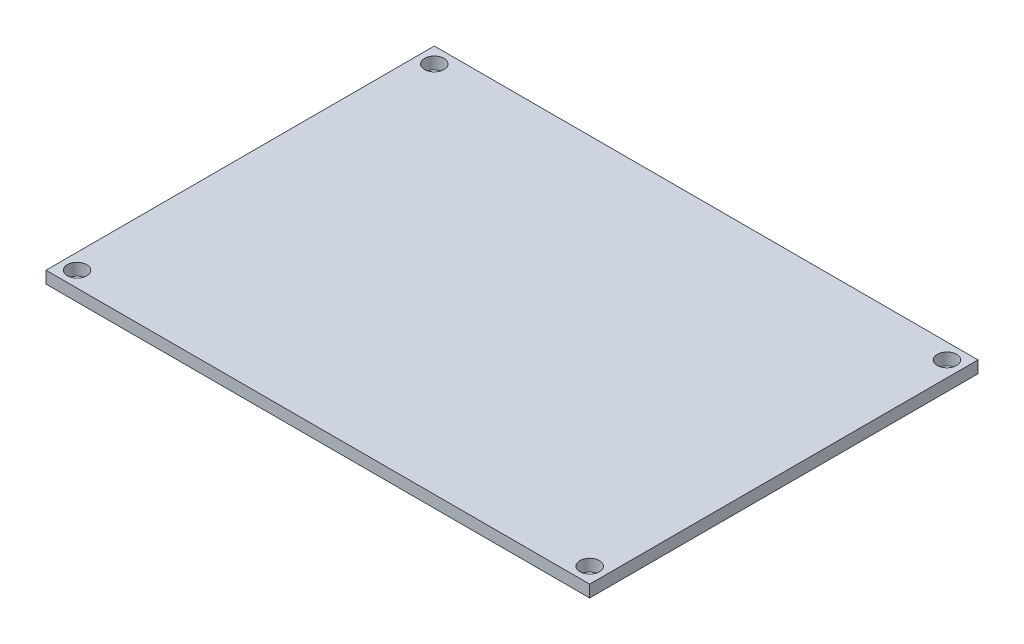
ISO-10303-21;
HEADER;
FILE_DESCRIPTION(('STEP AP214'),'2;1');
FILE_NAME('part.step','',(''),(''),'','','');
FILE_SCHEMA(('AUTOMOTIVE_DESIGN { 1 0 10303 214 1 1 1 1 }'));
ENDSEC;
DATA;
#1=APPLICATION_CONTEXT('core data for automotive mechanical design processes');
#2=APPLICATION_PROTOCOL_DEFINITION('international standard','automotive_design',2000,#1);
#3=PRODUCT_CONTEXT('',#1,'mechanical');
#4=PRODUCT('Part','Part','',(#3));
#5=PRODUCT_RELATED_PRODUCT_CATEGORY('part','',(#4));
#6=PRODUCT_DEFINITION_FORMATION('','',#4);
#7=PRODUCT_DEFINITION_CONTEXT('part definition',#1,'design');
#8=PRODUCT_DEFINITION('design','',#6,#7);
#9=PRODUCT_DEFINITION_SHAPE('','',#8);
#10=(LENGTH_UNIT() NAMED_UNIT(*) SI_UNIT(.MILLI.,.METRE.));
#11=(NAMED_UNIT(*) PLANE_ANGLE_UNIT() SI_UNIT($,.RADIAN.));
#12=(NAMED_UNIT(*) SI_UNIT($,.STERADIAN.) SOLID_ANGLE_UNIT());
#13=UNCERTAINTY_MEASURE_WITH_UNIT(LENGTH_MEASURE(1.E-05),#10,'distance_accuracy_value','');
#14=(GEOMETRIC_REPRESENTATION_CONTEXT(3) GLOBAL_UNCERTAINTY_ASSIGNED_CONTEXT((#13)) GLOBAL_UNIT_ASSIGNED_CONTEXT((#10,
#11,#12)) REPRESENTATION_CONTEXT('',''));
#15=CARTESIAN_POINT('',(0.,0.,0.));
#16=DIRECTION('',(0.,0.,1.));
#17=DIRECTION('',(1.,0.,0.));
#18=AXIS2_PLACEMENT_3D('',#15,#16,#17);
#19=CARTESIAN_POINT('',(0.,0.775,0.));
#20=DIRECTION('',(0.,-1.,0.));
#21=DIRECTION('',(0.,0.,-1.));
#22=AXIS2_PLACEMENT_3D('',#19,#20,#21);
#23=PLANE('',#22);
#24=DIRECTION('',(0.,0.,-1.));
#25=VECTOR('',#24,1.);
#26=CARTESIAN_POINT('',(35.,0.775,25.));
#27=LINE('',#26,#25);
#28=CARTESIAN_POINT('',(35.,0.775,25.));
#29=VERTEX_POINT('',#28);
#30=CARTESIAN_POINT('',(35.,0.775,-25.));
#31=VERTEX_POINT('',#30);
#32=EDGE_CURVE('E91',#29,#31,#27,.T.);
#33=ORIENTED_EDGE('',*,*,#32,.T.);
#34=DIRECTION('',(-1.,0.,0.));
#35=VECTOR('',#34,1.);
#36=CARTESIAN_POINT('',(-35.,0.775,-25.));
#37=LINE('',#36,#35);
#38=CARTESIAN_POINT('',(-35.,0.775,-25.));
#39=VERTEX_POINT('',#38);
#40=EDGE_CURVE('E86',#31,#39,#37,.T.);
#41=ORIENTED_EDGE('',*,*,#40,.T.);
#42=DIRECTION('',(0.,0.,1.));
#43=VECTOR('',#42,1.);
#44=CARTESIAN_POINT('',(-35.,0.775,25.));
#45=LINE('',#44,#43);
#46=CARTESIAN_POINT('',(-35.,0.775,25.));
#47=VERTEX_POINT('',#46);
#48=EDGE_CURVE('E89',#39,#47,#45,.T.);
#49=ORIENTED_EDGE('',*,*,#48,.T.);
#50=DIRECTION('',(1.,0.,0.));
#51=VECTOR('',#50,1.);
#52=CARTESIAN_POINT('',(-35.,0.775,25.));
#53=LINE('',#52,#51);
#54=EDGE_CURVE('E56',#47,#29,#53,.T.);
#55=ORIENTED_EDGE('',*,*,#54,.T.);
#56=EDGE_LOOP('',(#33,#41,#49,#55));
#57=FACE_BOUND('',#56,.T.);
#58=CARTESIAN_POINT('',(-33.,0.775,-23.));
#59=DIRECTION('',(0.,1.,0.));
#60=DIRECTION('',(0.,0.,1.));
#61=AXIS2_PLACEMENT_3D('',#58,#59,#60);
#62=CIRCLE('',#61,1.25);
#63=CARTESIAN_POINT('',(-33.,0.775,-21.75));
#64=VERTEX_POINT('',#63);
#65=EDGE_CURVE('E106',#64,#64,#62,.T.);
#66=ORIENTED_EDGE('',*,*,#65,.F.);
#67=EDGE_LOOP('',(#66));
#68=FACE_BOUND('',#67,.T.);
#69=CARTESIAN_POINT('',(33.,0.775,-23.));
#70=DIRECTION('',(0.,1.,0.));
#71=DIRECTION('',(0.,0.,1.));
#72=AXIS2_PLACEMENT_3D('',#69,#70,#71);
#73=CIRCLE('',#72,1.25);
#74=CARTESIAN_POINT('',(33.,0.775,-21.75));
#75=VERTEX_POINT('',#74);
#76=EDGE_CURVE('E121',#75,#75,#73,.T.);
#77=ORIENTED_EDGE('',*,*,#76,.F.);
#78=EDGE_LOOP('',(#77));
#79=FACE_BOUND('',#78,.T.);
#80=CARTESIAN_POINT('',(-33.,0.775,23.));
#81=DIRECTION('',(0.,1.,0.));
#82=DIRECTION('',(0.,0.,1.));
#83=AXIS2_PLACEMENT_3D('',#80,#81,#82);
#84=CIRCLE('',#83,1.25);
#85=CARTESIAN_POINT('',(-33.,0.775,24.25));
#86=VERTEX_POINT('',#85);
#87=EDGE_CURVE('E127',#86,#86,#84,.T.);
#88=ORIENTED_EDGE('',*,*,#87,.F.);
#89=EDGE_LOOP('',(#88));
#90=FACE_BOUND('',#89,.T.);
#91=CARTESIAN_POINT('',(33.,0.775,23.));
#92=DIRECTION('',(0.,1.,0.));
#93=DIRECTION('',(0.,0.,1.));
#94=AXIS2_PLACEMENT_3D('',#91,#92,#93);
#95=CIRCLE('',#94,1.25);
#96=CARTESIAN_POINT('',(33.,0.775,24.25));
#97=VERTEX_POINT('',#96);
#98=EDGE_CURVE('E133',#97,#97,#95,.T.);
#99=ORIENTED_EDGE('',*,*,#98,.F.);
#100=EDGE_LOOP('',(#99));
#101=FACE_BOUND('',#100,.T.);
#102=ADVANCED_FACE('F39',(#57,#68,#79,#90,#101),#23,.F.);
#103=CARTESIAN_POINT('',(0.,-0.775,0.));
#104=DIRECTION('',(0.,-1.,0.));
#105=DIRECTION('',(0.,0.,-1.));
#106=AXIS2_PLACEMENT_3D('',#103,#104,#105);
#107=PLANE('',#106);
#108=CARTESIAN_POINT('',(-33.,-0.775,23.));
#109=DIRECTION('',(0.,1.,0.));
#110=DIRECTION('',(0.,0.,1.));
#111=AXIS2_PLACEMENT_3D('',#108,#109,#110);
#112=CIRCLE('',#111,1.25);
#113=CARTESIAN_POINT('',(-33.,-0.775,24.25));
#114=VERTEX_POINT('',#113);
#115=EDGE_CURVE('E130',#114,#114,#112,.T.);
#116=ORIENTED_EDGE('',*,*,#115,.T.);
#117=EDGE_LOOP('',(#116));
#118=FACE_BOUND('',#117,.T.);
#119=CARTESIAN_POINT('',(-33.,-0.775,-23.));
#120=DIRECTION('',(0.,1.,0.));
#121=DIRECTION('',(0.,0.,1.));
#122=AXIS2_PLACEMENT_3D('',#119,#120,#121);
#123=CIRCLE('',#122,1.25);
#124=CARTESIAN_POINT('',(-33.,-0.775,-21.75));
#125=VERTEX_POINT('',#124);
#126=EDGE_CURVE('E118',#125,#125,#123,.T.);
#127=ORIENTED_EDGE('',*,*,#126,.T.);
#128=EDGE_LOOP('',(#127));
#129=FACE_BOUND('',#128,.T.);
#130=DIRECTION('',(0.,0.,-1.));
#131=VECTOR('',#130,1.);
#132=CARTESIAN_POINT('',(35.,-0.775,25.));
#133=LINE('',#132,#131);
#134=CARTESIAN_POINT('',(35.,-0.775,25.));
#135=VERTEX_POINT('',#134);
#136=CARTESIAN_POINT('',(35.,-0.775,-25.));
#137=VERTEX_POINT('',#136);
#138=EDGE_CURVE('E103',#135,#137,#133,.T.);
#139=ORIENTED_EDGE('',*,*,#138,.F.);
#140=DIRECTION('',(1.,0.,0.));
#141=VECTOR('',#140,1.);
#142=CARTESIAN_POINT('',(-35.,-0.775,25.));
#143=LINE('',#142,#141);
#144=CARTESIAN_POINT('',(-35.,-0.775,25.));
#145=VERTEX_POINT('',#144);
#146=EDGE_CURVE('E79',#145,#135,#143,.T.);
#147=ORIENTED_EDGE('',*,*,#146,.F.);
#148=DIRECTION('',(0.,0.,1.));
#149=VECTOR('',#148,1.);
#150=CARTESIAN_POINT('',(-35.,-0.775,25.));
#151=LINE('',#150,#149);
#152=CARTESIAN_POINT('',(-35.,-0.775,-25.));
#153=VERTEX_POINT('',#152);
#154=EDGE_CURVE('E73',#153,#145,#151,.T.);
#155=ORIENTED_EDGE('',*,*,#154,.F.);
#156=DIRECTION('',(-1.,0.,0.));
#157=VECTOR('',#156,1.);
#158=CARTESIAN_POINT('',(-35.,-0.775,-25.));
#159=LINE('',#158,#157);
#160=EDGE_CURVE('E95',#137,#153,#159,.T.);
#161=ORIENTED_EDGE('',*,*,#160,.F.);
#162=EDGE_LOOP('',(#139,#147,#155,#161));
#163=FACE_BOUND('',#162,.T.);
#164=CARTESIAN_POINT('',(33.,-0.775,-23.));
#165=DIRECTION('',(0.,1.,0.));
#166=DIRECTION('',(0.,0.,1.));
#167=AXIS2_PLACEMENT_3D('',#164,#165,#166);
#168=CIRCLE('',#167,1.25);
#169=CARTESIAN_POINT('',(33.,-0.775,-21.75));
#170=VERTEX_POINT('',#169);
#171=EDGE_CURVE('E124',#170,#170,#168,.T.);
#172=ORIENTED_EDGE('',*,*,#171,.T.);
#173=EDGE_LOOP('',(#172));
#174=FACE_BOUND('',#173,.T.);
#175=CARTESIAN_POINT('',(33.,-0.775,23.));
#176=DIRECTION('',(0.,1.,0.));
#177=DIRECTION('',(0.,0.,1.));
#178=AXIS2_PLACEMENT_3D('',#175,#176,#177);
#179=CIRCLE('',#178,1.25);
#180=CARTESIAN_POINT('',(33.,-0.775,24.25));
#181=VERTEX_POINT('',#180);
#182=EDGE_CURVE('E136',#181,#181,#179,.T.);
#183=ORIENTED_EDGE('',*,*,#182,.T.);
#184=EDGE_LOOP('',(#183));
#185=FACE_BOUND('',#184,.T.);
#186=ADVANCED_FACE('F114',(#118,#129,#163,#174,#185),#107,.T.);
#187=CARTESIAN_POINT('',(35.,0.775,25.));
#188=DIRECTION('',(-1.,0.,0.));
#189=DIRECTION('',(0.,0.,1.));
#190=AXIS2_PLACEMENT_3D('',#187,#188,#189);
#191=PLANE('',#190);
#192=ORIENTED_EDGE('',*,*,#138,.T.);
#193=DIRECTION('',(0.,-1.,0.));
#194=VECTOR('',#193,1.);
#195=CARTESIAN_POINT('',(35.,0.775,-25.));
#196=LINE('',#195,#194);
#197=EDGE_CURVE('E11',#31,#137,#196,.T.);
#198=ORIENTED_EDGE('',*,*,#197,.F.);
#199=ORIENTED_EDGE('',*,*,#32,.F.);
#200=DIRECTION('',(0.,-1.,0.));
#201=VECTOR('',#200,1.);
#202=CARTESIAN_POINT('',(35.,0.775,25.));
#203=LINE('',#202,#201);
#204=EDGE_CURVE('E99',#29,#135,#203,.T.);
#205=ORIENTED_EDGE('',*,*,#204,.T.);
#206=EDGE_LOOP('',(#192,#198,#199,#205));
#207=FACE_BOUND('',#206,.T.);
#208=ADVANCED_FACE('F41',(#207),#191,.F.);
#209=CARTESIAN_POINT('',(-35.,0.775,-25.));
#210=DIRECTION('',(0.,0.,1.));
#211=DIRECTION('',(1.,0.,0.));
#212=AXIS2_PLACEMENT_3D('',#209,#210,#211);
#213=PLANE('',#212);
#214=ORIENTED_EDGE('',*,*,#160,.T.);
#215=DIRECTION('',(0.,-1.,0.));
#216=VECTOR('',#215,1.);
#217=CARTESIAN_POINT('',(-35.,0.775,-25.));
#218=LINE('',#217,#216);
#219=EDGE_CURVE('E48',#39,#153,#218,.T.);
#220=ORIENTED_EDGE('',*,*,#219,.F.);
#221=ORIENTED_EDGE('',*,*,#40,.F.);
#222=ORIENTED_EDGE('',*,*,#197,.T.);
#223=EDGE_LOOP('',(#214,#220,#221,#222));
#224=FACE_BOUND('',#223,.T.);
#225=ADVANCED_FACE('F94',(#224),#213,.F.);
#226=CARTESIAN_POINT('',(-35.,0.775,25.));
#227=DIRECTION('',(1.,0.,0.));
#228=DIRECTION('',(0.,0.,-1.));
#229=AXIS2_PLACEMENT_3D('',#226,#227,#228);
#230=PLANE('',#229);
#231=ORIENTED_EDGE('',*,*,#154,.T.);
#232=DIRECTION('',(0.,-1.,0.));
#233=VECTOR('',#232,1.);
#234=CARTESIAN_POINT('',(-35.,0.775,25.));
#235=LINE('',#234,#233);
#236=EDGE_CURVE('E96',#47,#145,#235,.T.);
#237=ORIENTED_EDGE('',*,*,#236,.F.);
#238=ORIENTED_EDGE('',*,*,#48,.F.);
#239=ORIENTED_EDGE('',*,*,#219,.T.);
#240=EDGE_LOOP('',(#231,#237,#238,#239));
#241=FACE_BOUND('',#240,.T.);
#242=ADVANCED_FACE('F97',(#241),#230,.F.);
#243=CARTESIAN_POINT('',(-35.,0.775,25.));
#244=DIRECTION('',(0.,0.,-1.));
#245=DIRECTION('',(-1.,0.,0.));
#246=AXIS2_PLACEMENT_3D('',#243,#244,#245);
#247=PLANE('',#246);
#248=ORIENTED_EDGE('',*,*,#146,.T.);
#249=ORIENTED_EDGE('',*,*,#204,.F.);
#250=ORIENTED_EDGE('',*,*,#54,.F.);
#251=ORIENTED_EDGE('',*,*,#236,.T.);
#252=EDGE_LOOP('',(#248,#249,#250,#251));
#253=FACE_BOUND('',#252,.T.);
#254=ADVANCED_FACE('F111',(#253),#247,.F.);
#255=CARTESIAN_POINT('',(-33.,0.775,-23.));
#256=DIRECTION('',(0.,-1.,0.));
#257=DIRECTION('',(0.,0.,-1.));
#258=AXIS2_PLACEMENT_3D('',#255,#256,#257);
#259=CYLINDRICAL_SURFACE('',#258,1.25);
#260=ORIENTED_EDGE('',*,*,#65,.T.);
#261=EDGE_LOOP('',(#260));
#262=FACE_BOUND('',#261,.T.);
#263=ORIENTED_EDGE('',*,*,#126,.F.);
#264=EDGE_LOOP('',(#263));
#265=FACE_BOUND('',#264,.T.);
#266=ADVANCED_FACE('F153',(#262,#265),#259,.F.);
#267=CARTESIAN_POINT('',(33.,0.775,-23.));
#268=DIRECTION('',(0.,-1.,0.));
#269=DIRECTION('',(0.,0.,-1.));
#270=AXIS2_PLACEMENT_3D('',#267,#268,#269);
#271=CYLINDRICAL_SURFACE('',#270,1.25);
#272=ORIENTED_EDGE('',*,*,#76,.T.);
#273=EDGE_LOOP('',(#272));
#274=FACE_BOUND('',#273,.T.);
#275=ORIENTED_EDGE('',*,*,#171,.F.);
#276=EDGE_LOOP('',(#275));
#277=FACE_BOUND('',#276,.T.);
#278=ADVANCED_FACE('F198',(#274,#277),#271,.F.);
#279=CARTESIAN_POINT('',(-33.,0.775,23.));
#280=DIRECTION('',(0.,-1.,0.));
#281=DIRECTION('',(0.,0.,-1.));
#282=AXIS2_PLACEMENT_3D('',#279,#280,#281);
#283=CYLINDRICAL_SURFACE('',#282,1.25);
#284=ORIENTED_EDGE('',*,*,#87,.T.);
#285=EDGE_LOOP('',(#284));
#286=FACE_BOUND('',#285,.T.);
#287=ORIENTED_EDGE('',*,*,#115,.F.);
#288=EDGE_LOOP('',(#287));
#289=FACE_BOUND('',#288,.T.);
#290=ADVANCED_FACE('F206',(#286,#289),#283,.F.);
#291=CARTESIAN_POINT('',(33.,0.775,23.));
#292=DIRECTION('',(0.,-1.,0.));
#293=DIRECTION('',(0.,0.,-1.));
#294=AXIS2_PLACEMENT_3D('',#291,#292,#293);
#295=CYLINDRICAL_SURFACE('',#294,1.25);
#296=ORIENTED_EDGE('',*,*,#98,.T.);
#297=EDGE_LOOP('',(#296));
#298=FACE_BOUND('',#297,.T.);
#299=ORIENTED_EDGE('',*,*,#182,.F.);
#300=EDGE_LOOP('',(#299));
#301=FACE_BOUND('',#300,.T.);
#302=ADVANCED_FACE('F142',(#298,#301),#295,.F.);
#303=CLOSED_SHELL('',(#102,#186,#208,#225,#242,#254,#266,#278,#290,#302));
#304=MANIFOLD_SOLID_BREP('B2',#303);
#305=ADVANCED_BREP_SHAPE_REPRESENTATION('',(#18,#304),#14);
#306=SHAPE_DEFINITION_REPRESENTATION(#9,#305);
ENDSEC;
END-ISO-10303-21;
